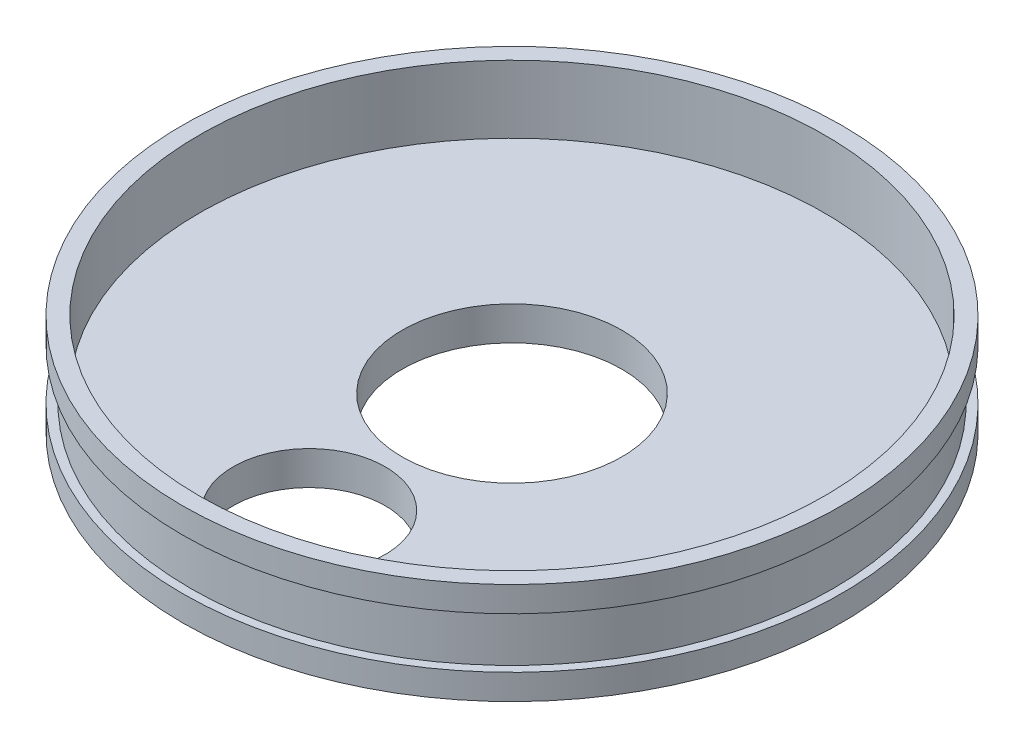
ISO-10303-21;
HEADER;
FILE_DESCRIPTION(('STEP AP214'),'2;1');
FILE_NAME('part.step','',(''),(''),'','','');
FILE_SCHEMA(('AUTOMOTIVE_DESIGN { 1 0 10303 214 1 1 1 1 }'));
ENDSEC;
DATA;
#1=APPLICATION_CONTEXT('core data for automotive mechanical design processes');
#2=APPLICATION_PROTOCOL_DEFINITION('international standard','automotive_design',2000,#1);
#3=PRODUCT_CONTEXT('',#1,'mechanical');
#4=PRODUCT('Part','Part','',(#3));
#5=PRODUCT_RELATED_PRODUCT_CATEGORY('part','',(#4));
#6=PRODUCT_DEFINITION_FORMATION('','',#4);
#7=PRODUCT_DEFINITION_CONTEXT('part definition',#1,'design');
#8=PRODUCT_DEFINITION('design','',#6,#7);
#9=PRODUCT_DEFINITION_SHAPE('','',#8);
#10=(LENGTH_UNIT() NAMED_UNIT(*) SI_UNIT(.MILLI.,.METRE.));
#11=(NAMED_UNIT(*) PLANE_ANGLE_UNIT() SI_UNIT($,.RADIAN.));
#12=(NAMED_UNIT(*) SI_UNIT($,.STERADIAN.) SOLID_ANGLE_UNIT());
#13=UNCERTAINTY_MEASURE_WITH_UNIT(LENGTH_MEASURE(1.E-05),#10,'distance_accuracy_value','');
#14=(GEOMETRIC_REPRESENTATION_CONTEXT(3) GLOBAL_UNCERTAINTY_ASSIGNED_CONTEXT((#13)) GLOBAL_UNIT_ASSIGNED_CONTEXT((#10,
#11,#12)) REPRESENTATION_CONTEXT('',''));
#15=CARTESIAN_POINT('',(0.,0.,0.));
#16=DIRECTION('',(0.,0.,1.));
#17=DIRECTION('',(1.,0.,0.));
#18=AXIS2_PLACEMENT_3D('',#15,#16,#17);
#19=CARTESIAN_POINT('',(0.,2.,0.));
#20=DIRECTION('',(0.,-1.,0.));
#21=DIRECTION('',(0.,0.,-1.));
#22=AXIS2_PLACEMENT_3D('',#19,#20,#21);
#23=CYLINDRICAL_SURFACE('',#22,19.5);
#24=CARTESIAN_POINT('',(0.,1.5,0.));
#25=DIRECTION('',(0.,-1.,0.));
#26=DIRECTION('',(0.,0.,-1.));
#27=AXIS2_PLACEMENT_3D('',#24,#25,#26);
#28=CIRCLE('',#27,19.5);
#29=CARTESIAN_POINT('',(0.,1.5,-19.5));
#30=VERTEX_POINT('',#29);
#31=EDGE_CURVE('E110',#30,#30,#28,.T.);
#32=ORIENTED_EDGE('',*,*,#31,.T.);
#33=EDGE_LOOP('',(#32));
#34=FACE_BOUND('',#33,.T.);
#35=CARTESIAN_POINT('',(0.,0.,0.));
#36=DIRECTION('',(0.,1.,0.));
#37=DIRECTION('',(0.,0.,1.));
#38=AXIS2_PLACEMENT_3D('',#35,#36,#37);
#39=CIRCLE('',#38,19.5);
#40=CARTESIAN_POINT('',(0.,0.,19.5));
#41=VERTEX_POINT('',#40);
#42=EDGE_CURVE('E71',#41,#41,#39,.T.);
#43=ORIENTED_EDGE('',*,*,#42,.T.);
#44=EDGE_LOOP('',(#43));
#45=FACE_BOUND('',#44,.T.);
#46=ADVANCED_FACE('F47',(#34,#45),#23,.T.);
#47=CARTESIAN_POINT('',(0.,2.,0.));
#48=DIRECTION('',(0.,-1.,0.));
#49=DIRECTION('',(0.,0.,-1.));
#50=AXIS2_PLACEMENT_3D('',#47,#48,#49);
#51=CYLINDRICAL_SURFACE('',#50,6.5);
#52=CARTESIAN_POINT('',(0.,2.,0.));
#53=DIRECTION('',(0.,1.,0.));
#54=DIRECTION('',(0.,0.,1.));
#55=AXIS2_PLACEMENT_3D('',#52,#53,#54);
#56=CIRCLE('',#55,6.5);
#57=CARTESIAN_POINT('',(0.,2.,6.5));
#58=VERTEX_POINT('',#57);
#59=EDGE_CURVE('E62',#58,#58,#56,.T.);
#60=ORIENTED_EDGE('',*,*,#59,.T.);
#61=EDGE_LOOP('',(#60));
#62=FACE_BOUND('',#61,.T.);
#63=CARTESIAN_POINT('',(0.,0.,0.));
#64=DIRECTION('',(0.,1.,0.));
#65=DIRECTION('',(0.,0.,1.));
#66=AXIS2_PLACEMENT_3D('',#63,#64,#65);
#67=CIRCLE('',#66,6.5);
#68=CARTESIAN_POINT('',(0.,0.,6.5));
#69=VERTEX_POINT('',#68);
#70=EDGE_CURVE('E74',#69,#69,#67,.T.);
#71=ORIENTED_EDGE('',*,*,#70,.F.);
#72=EDGE_LOOP('',(#71));
#73=FACE_BOUND('',#72,.T.);
#74=ADVANCED_FACE('F98',(#62,#73),#51,.F.);
#75=CARTESIAN_POINT('',(0.,4.5,0.));
#76=DIRECTION('',(0.,-1.,0.));
#77=DIRECTION('',(0.,0.,-1.));
#78=AXIS2_PLACEMENT_3D('',#75,#76,#77);
#79=CIRCLE('',#78,19.5);
#80=CARTESIAN_POINT('',(0.,4.5,-19.5));
#81=VERTEX_POINT('',#80);
#82=EDGE_CURVE('E141',#81,#81,#79,.T.);
#83=ORIENTED_EDGE('',*,*,#82,.F.);
#84=EDGE_LOOP('',(#83));
#85=FACE_BOUND('',#84,.T.);
#86=CARTESIAN_POINT('',(0.,6.,0.));
#87=DIRECTION('',(0.,1.,0.));
#88=DIRECTION('',(0.,0.,1.));
#89=AXIS2_PLACEMENT_3D('',#86,#87,#88);
#90=CIRCLE('',#89,19.5);
#91=CARTESIAN_POINT('',(0.,6.,19.5));
#92=VERTEX_POINT('',#91);
#93=EDGE_CURVE('E66',#92,#92,#90,.T.);
#94=ORIENTED_EDGE('',*,*,#93,.F.);
#95=EDGE_LOOP('',(#94));
#96=FACE_BOUND('',#95,.T.);
#97=ADVANCED_FACE('F49',(#85,#96),#23,.T.);
#98=CARTESIAN_POINT('',(0.,2.,12.));
#99=DIRECTION('',(0.,-1.,0.));
#100=DIRECTION('',(0.,0.,-1.));
#101=AXIS2_PLACEMENT_3D('',#98,#99,#100);
#102=CYLINDRICAL_SURFACE('',#101,4.5);
#103=CARTESIAN_POINT('',(0.,2.,12.));
#104=DIRECTION('',(0.,1.,0.));
#105=DIRECTION('',(0.,0.,1.));
#106=AXIS2_PLACEMENT_3D('',#103,#104,#105);
#107=CIRCLE('',#106,4.5);
#108=CARTESIAN_POINT('',(0.,2.,16.5));
#109=VERTEX_POINT('',#108);
#110=EDGE_CURVE('E56',#109,#109,#107,.T.);
#111=ORIENTED_EDGE('',*,*,#110,.T.);
#112=EDGE_LOOP('',(#111));
#113=FACE_BOUND('',#112,.T.);
#114=CARTESIAN_POINT('',(0.,0.,12.));
#115=DIRECTION('',(0.,1.,0.));
#116=DIRECTION('',(0.,0.,1.));
#117=AXIS2_PLACEMENT_3D('',#114,#115,#116);
#118=CIRCLE('',#117,4.5);
#119=CARTESIAN_POINT('',(0.,0.,16.5));
#120=VERTEX_POINT('',#119);
#121=EDGE_CURVE('E51',#120,#120,#118,.T.);
#122=ORIENTED_EDGE('',*,*,#121,.F.);
#123=EDGE_LOOP('',(#122));
#124=FACE_BOUND('',#123,.T.);
#125=ADVANCED_FACE('F86',(#113,#124),#102,.F.);
#126=CARTESIAN_POINT('',(0.,2.,0.));
#127=DIRECTION('',(0.,1.,0.));
#128=DIRECTION('',(0.,0.,1.));
#129=AXIS2_PLACEMENT_3D('',#126,#127,#128);
#130=PLANE('',#129);
#131=CARTESIAN_POINT('',(0.,2.,0.));
#132=DIRECTION('',(0.,1.,0.));
#133=DIRECTION('',(0.,0.,1.));
#134=AXIS2_PLACEMENT_3D('',#131,#132,#133);
#135=CIRCLE('',#134,18.5);
#136=CARTESIAN_POINT('',(0.,2.,18.5));
#137=VERTEX_POINT('',#136);
#138=EDGE_CURVE('E10',#137,#137,#135,.F.);
#139=ORIENTED_EDGE('',*,*,#138,.F.);
#140=EDGE_LOOP('',(#139));
#141=FACE_BOUND('',#140,.T.);
#142=ORIENTED_EDGE('',*,*,#59,.F.);
#143=EDGE_LOOP('',(#142));
#144=FACE_BOUND('',#143,.T.);
#145=ORIENTED_EDGE('',*,*,#110,.F.);
#146=EDGE_LOOP('',(#145));
#147=FACE_BOUND('',#146,.T.);
#148=ADVANCED_FACE('F88',(#141,#144,#147),#130,.T.);
#149=CARTESIAN_POINT('',(0.,0.,0.));
#150=DIRECTION('',(0.,1.,0.));
#151=DIRECTION('',(0.,0.,1.));
#152=AXIS2_PLACEMENT_3D('',#149,#150,#151);
#153=PLANE('',#152);
#154=ORIENTED_EDGE('',*,*,#70,.T.);
#155=EDGE_LOOP('',(#154));
#156=FACE_BOUND('',#155,.T.);
#157=ORIENTED_EDGE('',*,*,#121,.T.);
#158=EDGE_LOOP('',(#157));
#159=FACE_BOUND('',#158,.T.);
#160=ORIENTED_EDGE('',*,*,#42,.F.);
#161=EDGE_LOOP('',(#160));
#162=FACE_BOUND('',#161,.T.);
#163=ADVANCED_FACE('F83',(#156,#159,#162),#153,.F.);
#164=CARTESIAN_POINT('',(0.,6.,0.));
#165=DIRECTION('',(0.,-1.,0.));
#166=DIRECTION('',(0.,0.,-1.));
#167=AXIS2_PLACEMENT_3D('',#164,#165,#166);
#168=CYLINDRICAL_SURFACE('',#167,18.5);
#169=ORIENTED_EDGE('',*,*,#138,.T.);
#170=EDGE_LOOP('',(#169));
#171=FACE_BOUND('',#170,.T.);
#172=CARTESIAN_POINT('',(0.,6.,0.));
#173=DIRECTION('',(0.,1.,0.));
#174=DIRECTION('',(0.,0.,1.));
#175=AXIS2_PLACEMENT_3D('',#172,#173,#174);
#176=CIRCLE('',#175,18.5);
#177=CARTESIAN_POINT('',(0.,6.,18.5));
#178=VERTEX_POINT('',#177);
#179=EDGE_CURVE('E152',#178,#178,#176,.T.);
#180=ORIENTED_EDGE('',*,*,#179,.T.);
#181=EDGE_LOOP('',(#180));
#182=FACE_BOUND('',#181,.T.);
#183=ADVANCED_FACE('F113',(#171,#182),#168,.F.);
#184=CARTESIAN_POINT('',(0.,6.,0.));
#185=DIRECTION('',(0.,1.,0.));
#186=DIRECTION('',(0.,0.,1.));
#187=AXIS2_PLACEMENT_3D('',#184,#185,#186);
#188=PLANE('',#187);
#189=ORIENTED_EDGE('',*,*,#179,.F.);
#190=EDGE_LOOP('',(#189));
#191=FACE_BOUND('',#190,.T.);
#192=ORIENTED_EDGE('',*,*,#93,.T.);
#193=EDGE_LOOP('',(#192));
#194=FACE_BOUND('',#193,.T.);
#195=ADVANCED_FACE('F117',(#191,#194),#188,.T.);
#196=CARTESIAN_POINT('',(0.,1.5,-19.5));
#197=DIRECTION('',(0.,-1.,0.));
#198=DIRECTION('',(0.,0.,-1.));
#199=AXIS2_PLACEMENT_3D('',#196,#197,#198);
#200=PLANE('',#199);
#201=ORIENTED_EDGE('',*,*,#31,.F.);
#202=EDGE_LOOP('',(#201));
#203=FACE_BOUND('',#202,.T.);
#204=CARTESIAN_POINT('',(0.,1.5,0.));
#205=DIRECTION('',(0.,-1.,0.));
#206=DIRECTION('',(0.,0.,-1.));
#207=AXIS2_PLACEMENT_3D('',#204,#205,#206);
#208=CIRCLE('',#207,19.);
#209=CARTESIAN_POINT('',(0.,1.5,-19.));
#210=VERTEX_POINT('',#209);
#211=EDGE_CURVE('E145',#210,#210,#208,.T.);
#212=ORIENTED_EDGE('',*,*,#211,.T.);
#213=EDGE_LOOP('',(#212));
#214=FACE_BOUND('',#213,.T.);
#215=ADVANCED_FACE('F121',(#203,#214),#200,.F.);
#216=CARTESIAN_POINT('',(0.,0.,0.));
#217=DIRECTION('',(0.,-1.,0.));
#218=DIRECTION('',(0.,0.,-1.));
#219=AXIS2_PLACEMENT_3D('',#216,#217,#218);
#220=CYLINDRICAL_SURFACE('',#219,19.);
#221=ORIENTED_EDGE('',*,*,#211,.F.);
#222=EDGE_LOOP('',(#221));
#223=FACE_BOUND('',#222,.T.);
#224=CARTESIAN_POINT('',(0.,4.5,0.));
#225=DIRECTION('',(0.,-1.,0.));
#226=DIRECTION('',(0.,0.,-1.));
#227=AXIS2_PLACEMENT_3D('',#224,#225,#226);
#228=CIRCLE('',#227,19.);
#229=CARTESIAN_POINT('',(0.,4.5,-19.));
#230=VERTEX_POINT('',#229);
#231=EDGE_CURVE('E138',#230,#230,#228,.T.);
#232=ORIENTED_EDGE('',*,*,#231,.T.);
#233=EDGE_LOOP('',(#232));
#234=FACE_BOUND('',#233,.T.);
#235=ADVANCED_FACE('F125',(#223,#234),#220,.T.);
#236=CARTESIAN_POINT('',(0.,4.5,-19.));
#237=DIRECTION('',(0.,1.,0.));
#238=DIRECTION('',(0.,0.,1.));
#239=AXIS2_PLACEMENT_3D('',#236,#237,#238);
#240=PLANE('',#239);
#241=ORIENTED_EDGE('',*,*,#231,.F.);
#242=EDGE_LOOP('',(#241));
#243=FACE_BOUND('',#242,.T.);
#244=ORIENTED_EDGE('',*,*,#82,.T.);
#245=EDGE_LOOP('',(#244));
#246=FACE_BOUND('',#245,.T.);
#247=ADVANCED_FACE('F129',(#243,#246),#240,.F.);
#248=CLOSED_SHELL('',(#46,#74,#97,#125,#148,#163,#183,#195,#215,#235,#247));
#249=MANIFOLD_SOLID_BREP('B2',#248);
#250=ADVANCED_BREP_SHAPE_REPRESENTATION('',(#18,#249),#14);
#251=SHAPE_DEFINITION_REPRESENTATION(#9,#250);
ENDSEC;
END-ISO-10303-21;
